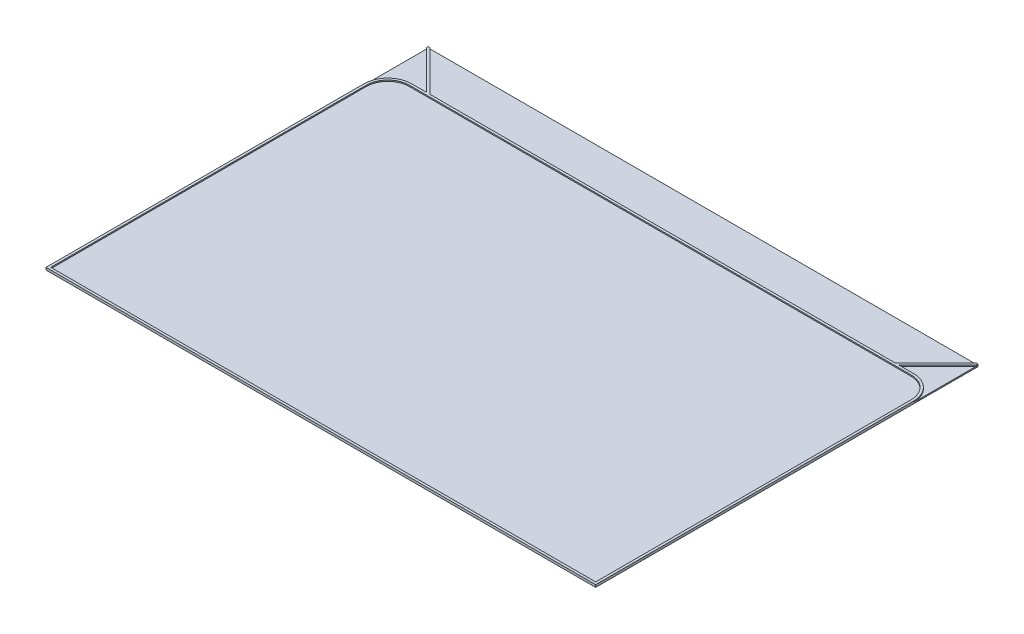
ISO-10303-21;
HEADER;
FILE_DESCRIPTION(('STEP AP214'),'2;1');
FILE_NAME('part.step','',(''),(''),'','','');
FILE_SCHEMA(('AUTOMOTIVE_DESIGN { 1 0 10303 214 1 1 1 1 }'));
ENDSEC;
DATA;
#1=APPLICATION_CONTEXT('core data for automotive mechanical design processes');
#2=APPLICATION_PROTOCOL_DEFINITION('international standard','automotive_design',2000,#1);
#3=PRODUCT_CONTEXT('',#1,'mechanical');
#4=PRODUCT('Part','Part','',(#3));
#5=PRODUCT_RELATED_PRODUCT_CATEGORY('part','',(#4));
#6=PRODUCT_DEFINITION_FORMATION('','',#4);
#7=PRODUCT_DEFINITION_CONTEXT('part definition',#1,'design');
#8=PRODUCT_DEFINITION('design','',#6,#7);
#9=PRODUCT_DEFINITION_SHAPE('','',#8);
#10=(LENGTH_UNIT() NAMED_UNIT(*) SI_UNIT(.MILLI.,.METRE.));
#11=(NAMED_UNIT(*) PLANE_ANGLE_UNIT() SI_UNIT($,.RADIAN.));
#12=(NAMED_UNIT(*) SI_UNIT($,.STERADIAN.) SOLID_ANGLE_UNIT());
#13=UNCERTAINTY_MEASURE_WITH_UNIT(LENGTH_MEASURE(1.E-05),#10,'distance_accuracy_value','');
#14=(GEOMETRIC_REPRESENTATION_CONTEXT(3) GLOBAL_UNCERTAINTY_ASSIGNED_CONTEXT((#13)) GLOBAL_UNIT_ASSIGNED_CONTEXT((#10,
#11,#12)) REPRESENTATION_CONTEXT('',''));
#15=CARTESIAN_POINT('',(0.,0.,0.));
#16=DIRECTION('',(0.,0.,1.));
#17=DIRECTION('',(1.,0.,0.));
#18=AXIS2_PLACEMENT_3D('',#15,#16,#17);
#19=CARTESIAN_POINT('',(0.,0.5,0.));
#20=DIRECTION('',(0.,1.,0.));
#21=DIRECTION('',(0.,0.,1.));
#22=AXIS2_PLACEMENT_3D('',#19,#20,#21);
#23=PLANE('',#22);
#24=DIRECTION('',(-0.707106781186548,0.,-0.707106781186547));
#25=VECTOR('',#24,1.);
#26=CARTESIAN_POINT('',(-17.1464466094066,0.5,17.1464466094067));
#27=LINE('',#26,#25);
#28=CARTESIAN_POINT('',(-97.3223304703364,0.5,-63.0294372515229));
#29=VERTEX_POINT('',#28);
#30=CARTESIAN_POINT('',(-114.292893218814,0.5,-80.));
#31=VERTEX_POINT('',#30);
#32=EDGE_CURVE('E278',#29,#31,#27,.T.);
#33=ORIENTED_EDGE('',*,*,#32,.F.);
#34=DIRECTION('',(-1.,0.,0.));
#35=VECTOR('',#34,1.);
#36=CARTESIAN_POINT('',(0.,0.5,-63.0294372515229));
#37=LINE('',#36,#35);
#38=CARTESIAN_POINT('',(97.3223304703364,0.5,-63.0294372515229));
#39=VERTEX_POINT('',#38);
#40=EDGE_CURVE('E272',#39,#29,#37,.T.);
#41=ORIENTED_EDGE('',*,*,#40,.F.);
#42=DIRECTION('',(0.707106781186548,0.,-0.707106781186547));
#43=VECTOR('',#42,1.);
#44=CARTESIAN_POINT('',(17.1464466094066,0.5,17.1464466094067));
#45=LINE('',#44,#43);
#46=CARTESIAN_POINT('',(114.292893218814,0.5,-80.));
#47=VERTEX_POINT('',#46);
#48=EDGE_CURVE('E275',#39,#47,#45,.T.);
#49=ORIENTED_EDGE('',*,*,#48,.T.);
#50=DIRECTION('',(-1.,0.,0.));
#51=VECTOR('',#50,1.);
#52=CARTESIAN_POINT('',(-115.,0.5,-80.));
#53=LINE('',#52,#51);
#54=EDGE_CURVE('E333',#47,#31,#53,.T.);
#55=ORIENTED_EDGE('',*,*,#54,.T.);
#56=EDGE_LOOP('',(#33,#41,#49,#55));
#57=FACE_BOUND('',#56,.T.);
#58=ADVANCED_FACE('F37',(#57),#23,.T.);
#59=DIRECTION('',(0.,0.,1.));
#60=VECTOR('',#59,1.);
#61=CARTESIAN_POINT('',(-115.,0.5,-80.));
#62=LINE('',#61,#60);
#63=CARTESIAN_POINT('',(-115.,0.5,-79.2928932188135));
#64=VERTEX_POINT('',#63);
#65=CARTESIAN_POINT('',(-115.,0.5,-53.0294372515229));
#66=VERTEX_POINT('',#65);
#67=EDGE_CURVE('E337',#64,#66,#62,.T.);
#68=ORIENTED_EDGE('',*,*,#67,.T.);
#69=CARTESIAN_POINT('',(-105.,0.5,-53.0294372515229));
#70=DIRECTION('',(0.,1.,0.));
#71=DIRECTION('',(0.,0.,1.));
#72=AXIS2_PLACEMENT_3D('',#69,#70,#71);
#73=CIRCLE('',#72,10.);
#74=CARTESIAN_POINT('',(-105.,0.5,-63.0294372515229));
#75=VERTEX_POINT('',#74);
#76=EDGE_CURVE('E191',#66,#75,#73,.F.);
#77=ORIENTED_EDGE('',*,*,#76,.T.);
#78=CARTESIAN_POINT('',(-98.7365440327095,0.5,-63.0294372515229));
#79=VERTEX_POINT('',#78);
#80=EDGE_CURVE('E271',#79,#75,#37,.T.);
#81=ORIENTED_EDGE('',*,*,#80,.F.);
#82=DIRECTION('',(0.707106781186548,0.,0.707106781186548));
#83=VECTOR('',#82,1.);
#84=CARTESIAN_POINT('',(-17.8535533905933,0.5,17.8535533905933));
#85=LINE('',#84,#83);
#86=EDGE_CURVE('E280',#64,#79,#85,.T.);
#87=ORIENTED_EDGE('',*,*,#86,.F.);
#88=EDGE_LOOP('',(#68,#77,#81,#87));
#89=FACE_BOUND('',#88,.T.);
#90=ADVANCED_FACE('F407',(#89),#23,.T.);
#91=DIRECTION('',(0.,0.,-1.));
#92=VECTOR('',#91,1.);
#93=CARTESIAN_POINT('',(115.,0.5,-80.));
#94=LINE('',#93,#92);
#95=CARTESIAN_POINT('',(115.,0.5,-53.0294372515229));
#96=VERTEX_POINT('',#95);
#97=CARTESIAN_POINT('',(115.,0.5,-79.2928932188133));
#98=VERTEX_POINT('',#97);
#99=EDGE_CURVE('E330',#96,#98,#94,.T.);
#100=ORIENTED_EDGE('',*,*,#99,.T.);
#101=DIRECTION('',(-0.707106781186548,0.,0.707106781186548));
#102=VECTOR('',#101,1.);
#103=CARTESIAN_POINT('',(17.8535533905933,0.5,17.8535533905933));
#104=LINE('',#103,#102);
#105=CARTESIAN_POINT('',(98.7365440327095,0.5,-63.0294372515229));
#106=VERTEX_POINT('',#105);
#107=EDGE_CURVE('E270',#98,#106,#104,.T.);
#108=ORIENTED_EDGE('',*,*,#107,.T.);
#109=CARTESIAN_POINT('',(105.,0.5,-63.0294372515229));
#110=VERTEX_POINT('',#109);
#111=EDGE_CURVE('E267',#110,#106,#37,.T.);
#112=ORIENTED_EDGE('',*,*,#111,.F.);
#113=CARTESIAN_POINT('',(105.,0.5,-53.0294372515229));
#114=DIRECTION('',(0.,1.,0.));
#115=DIRECTION('',(0.,0.,1.));
#116=AXIS2_PLACEMENT_3D('',#113,#114,#115);
#117=CIRCLE('',#116,10.);
#118=EDGE_CURVE('E264',#110,#96,#117,.F.);
#119=ORIENTED_EDGE('',*,*,#118,.T.);
#120=EDGE_LOOP('',(#100,#108,#112,#119));
#121=FACE_BOUND('',#120,.T.);
#122=ADVANCED_FACE('F409',(#121),#23,.T.);
#123=CARTESIAN_POINT('',(115.,0.5,-80.));
#124=DIRECTION('',(-1.,0.,0.));
#125=DIRECTION('',(0.,0.,1.));
#126=AXIS2_PLACEMENT_3D('',#123,#124,#125);
#127=PLANE('',#126);
#128=DIRECTION('',(0.,0.,-1.));
#129=VECTOR('',#128,1.);
#130=CARTESIAN_POINT('',(115.,0.,-80.));
#131=LINE('',#130,#129);
#132=CARTESIAN_POINT('',(115.,0.,80.));
#133=VERTEX_POINT('',#132);
#134=CARTESIAN_POINT('',(115.,0.,-80.));
#135=VERTEX_POINT('',#134);
#136=EDGE_CURVE('E306',#133,#135,#131,.T.);
#137=ORIENTED_EDGE('',*,*,#136,.T.);
#138=DIRECTION('',(0.,-1.,0.));
#139=VECTOR('',#138,1.);
#140=CARTESIAN_POINT('',(115.,0.5,-80.));
#141=LINE('',#140,#139);
#142=CARTESIAN_POINT('',(115.,1.,-80.));
#143=VERTEX_POINT('',#142);
#144=EDGE_CURVE('E11',#143,#135,#141,.T.);
#145=ORIENTED_EDGE('',*,*,#144,.F.);
#146=DIRECTION('',(0.,0.,-1.));
#147=VECTOR('',#146,1.);
#148=CARTESIAN_POINT('',(115.,1.,0.));
#149=LINE('',#148,#147);
#150=CARTESIAN_POINT('',(115.,1.,-79.2928932188133));
#151=VERTEX_POINT('',#150);
#152=EDGE_CURVE('E229',#151,#143,#149,.T.);
#153=ORIENTED_EDGE('',*,*,#152,.F.);
#154=DIRECTION('',(0.,-1.,0.));
#155=VECTOR('',#154,1.);
#156=CARTESIAN_POINT('',(115.,1.,-79.2928932188133));
#157=LINE('',#156,#155);
#158=EDGE_CURVE('E323',#151,#98,#157,.T.);
#159=ORIENTED_EDGE('',*,*,#158,.T.);
#160=ORIENTED_EDGE('',*,*,#99,.F.);
#161=DIRECTION('',(0.,-1.,0.));
#162=VECTOR('',#161,1.);
#163=CARTESIAN_POINT('',(115.,1.,-53.0294372515229));
#164=LINE('',#163,#162);
#165=CARTESIAN_POINT('',(115.,1.,-53.0294372515229));
#166=VERTEX_POINT('',#165);
#167=EDGE_CURVE('E196',#166,#96,#164,.T.);
#168=ORIENTED_EDGE('',*,*,#167,.F.);
#169=DIRECTION('',(0.,0.,-1.));
#170=VECTOR('',#169,1.);
#171=CARTESIAN_POINT('',(115.,1.,0.));
#172=LINE('',#171,#170);
#173=CARTESIAN_POINT('',(115.,1.,80.));
#174=VERTEX_POINT('',#173);
#175=EDGE_CURVE('E218',#174,#166,#172,.T.);
#176=ORIENTED_EDGE('',*,*,#175,.F.);
#177=DIRECTION('',(0.,-1.,0.));
#178=VECTOR('',#177,1.);
#179=CARTESIAN_POINT('',(115.,0.5,80.));
#180=LINE('',#179,#178);
#181=EDGE_CURVE('E339',#174,#133,#180,.T.);
#182=ORIENTED_EDGE('',*,*,#181,.T.);
#183=EDGE_LOOP('',(#137,#145,#153,#159,#160,#168,#176,#182));
#184=FACE_BOUND('',#183,.T.);
#185=ADVANCED_FACE('F39',(#184),#127,.F.);
#186=CARTESIAN_POINT('',(-115.,0.5,-80.));
#187=DIRECTION('',(0.,0.,1.));
#188=DIRECTION('',(1.,0.,0.));
#189=AXIS2_PLACEMENT_3D('',#186,#187,#188);
#190=PLANE('',#189);
#191=DIRECTION('',(-1.,0.,0.));
#192=VECTOR('',#191,1.);
#193=CARTESIAN_POINT('',(-115.,0.,-80.));
#194=LINE('',#193,#192);
#195=CARTESIAN_POINT('',(-115.,0.,-80.));
#196=VERTEX_POINT('',#195);
#197=EDGE_CURVE('E342',#135,#196,#194,.T.);
#198=ORIENTED_EDGE('',*,*,#197,.T.);
#199=DIRECTION('',(0.,-1.,0.));
#200=VECTOR('',#199,1.);
#201=CARTESIAN_POINT('',(-115.,0.5,-80.));
#202=LINE('',#201,#200);
#203=CARTESIAN_POINT('',(-115.,1.,-80.));
#204=VERTEX_POINT('',#203);
#205=EDGE_CURVE('E45',#204,#196,#202,.T.);
#206=ORIENTED_EDGE('',*,*,#205,.F.);
#207=DIRECTION('',(-1.,0.,0.));
#208=VECTOR('',#207,1.);
#209=CARTESIAN_POINT('',(0.,1.,-80.));
#210=LINE('',#209,#208);
#211=CARTESIAN_POINT('',(-114.292893218814,1.,-80.));
#212=VERTEX_POINT('',#211);
#213=EDGE_CURVE('E239',#212,#204,#210,.T.);
#214=ORIENTED_EDGE('',*,*,#213,.F.);
#215=DIRECTION('',(0.,-1.,0.));
#216=VECTOR('',#215,1.);
#217=CARTESIAN_POINT('',(-114.292893218814,1.,-80.));
#218=LINE('',#217,#216);
#219=EDGE_CURVE('E313',#212,#31,#218,.T.);
#220=ORIENTED_EDGE('',*,*,#219,.T.);
#221=ORIENTED_EDGE('',*,*,#54,.F.);
#222=DIRECTION('',(0.,-1.,0.));
#223=VECTOR('',#222,1.);
#224=CARTESIAN_POINT('',(114.292893218814,1.,-80.));
#225=LINE('',#224,#223);
#226=CARTESIAN_POINT('',(114.292893218814,1.,-80.));
#227=VERTEX_POINT('',#226);
#228=EDGE_CURVE('E321',#227,#47,#225,.T.);
#229=ORIENTED_EDGE('',*,*,#228,.F.);
#230=DIRECTION('',(-1.,0.,0.));
#231=VECTOR('',#230,1.);
#232=CARTESIAN_POINT('',(0.,1.,-80.));
#233=LINE('',#232,#231);
#234=EDGE_CURVE('E232',#143,#227,#233,.T.);
#235=ORIENTED_EDGE('',*,*,#234,.F.);
#236=ORIENTED_EDGE('',*,*,#144,.T.);
#237=EDGE_LOOP('',(#198,#206,#214,#220,#221,#229,#235,#236));
#238=FACE_BOUND('',#237,.T.);
#239=ADVANCED_FACE('F382',(#238),#190,.F.);
#240=CARTESIAN_POINT('',(-115.,0.5,-80.));
#241=DIRECTION('',(1.,0.,0.));
#242=DIRECTION('',(0.,0.,-1.));
#243=AXIS2_PLACEMENT_3D('',#240,#241,#242);
#244=PLANE('',#243);
#245=DIRECTION('',(0.,0.,1.));
#246=VECTOR('',#245,1.);
#247=CARTESIAN_POINT('',(-115.,0.,-80.));
#248=LINE('',#247,#246);
#249=CARTESIAN_POINT('',(-115.,0.,80.));
#250=VERTEX_POINT('',#249);
#251=EDGE_CURVE('E344',#196,#250,#248,.T.);
#252=ORIENTED_EDGE('',*,*,#251,.T.);
#253=DIRECTION('',(0.,-1.,0.));
#254=VECTOR('',#253,1.);
#255=CARTESIAN_POINT('',(-115.,0.5,80.));
#256=LINE('',#255,#254);
#257=CARTESIAN_POINT('',(-115.,1.,80.));
#258=VERTEX_POINT('',#257);
#259=EDGE_CURVE('E202',#258,#250,#256,.T.);
#260=ORIENTED_EDGE('',*,*,#259,.F.);
#261=DIRECTION('',(0.,0.,1.));
#262=VECTOR('',#261,1.);
#263=CARTESIAN_POINT('',(-115.,1.,0.));
#264=LINE('',#263,#262);
#265=CARTESIAN_POINT('',(-115.,1.,-53.0294372515229));
#266=VERTEX_POINT('',#265);
#267=EDGE_CURVE('E199',#266,#258,#264,.T.);
#268=ORIENTED_EDGE('',*,*,#267,.F.);
#269=DIRECTION('',(0.,-1.,0.));
#270=VECTOR('',#269,1.);
#271=CARTESIAN_POINT('',(-115.,1.,-53.0294372515229));
#272=LINE('',#271,#270);
#273=EDGE_CURVE('E185',#266,#66,#272,.T.);
#274=ORIENTED_EDGE('',*,*,#273,.T.);
#275=ORIENTED_EDGE('',*,*,#67,.F.);
#276=DIRECTION('',(0.,-1.,0.));
#277=VECTOR('',#276,1.);
#278=CARTESIAN_POINT('',(-115.,1.,-79.2928932188135));
#279=LINE('',#278,#277);
#280=CARTESIAN_POINT('',(-115.,1.,-79.2928932188135));
#281=VERTEX_POINT('',#280);
#282=EDGE_CURVE('E311',#281,#64,#279,.T.);
#283=ORIENTED_EDGE('',*,*,#282,.F.);
#284=DIRECTION('',(0.,0.,1.));
#285=VECTOR('',#284,1.);
#286=CARTESIAN_POINT('',(-115.,1.,0.));
#287=LINE('',#286,#285);
#288=EDGE_CURVE('E242',#204,#281,#287,.T.);
#289=ORIENTED_EDGE('',*,*,#288,.F.);
#290=ORIENTED_EDGE('',*,*,#205,.T.);
#291=EDGE_LOOP('',(#252,#260,#268,#274,#275,#283,#289,#290));
#292=FACE_BOUND('',#291,.T.);
#293=ADVANCED_FACE('F200',(#292),#244,.F.);
#294=CARTESIAN_POINT('',(-115.,0.5,80.));
#295=DIRECTION('',(0.,0.,-1.));
#296=DIRECTION('',(-1.,0.,0.));
#297=AXIS2_PLACEMENT_3D('',#294,#295,#296);
#298=PLANE('',#297);
#299=DIRECTION('',(1.,0.,0.));
#300=VECTOR('',#299,1.);
#301=CARTESIAN_POINT('',(-115.,0.,80.));
#302=LINE('',#301,#300);
#303=EDGE_CURVE('E334',#250,#133,#302,.T.);
#304=ORIENTED_EDGE('',*,*,#303,.T.);
#305=ORIENTED_EDGE('',*,*,#181,.F.);
#306=DIRECTION('',(1.,0.,0.));
#307=VECTOR('',#306,1.);
#308=CARTESIAN_POINT('',(0.,1.,80.));
#309=LINE('',#308,#307);
#310=EDGE_CURVE('E206',#258,#174,#309,.T.);
#311=ORIENTED_EDGE('',*,*,#310,.F.);
#312=ORIENTED_EDGE('',*,*,#259,.T.);
#313=EDGE_LOOP('',(#304,#305,#311,#312));
#314=FACE_BOUND('',#313,.T.);
#315=ADVANCED_FACE('F360',(#314),#298,.F.);
#316=CARTESIAN_POINT('',(0.,0.,0.));
#317=DIRECTION('',(0.,1.,0.));
#318=DIRECTION('',(0.,0.,1.));
#319=AXIS2_PLACEMENT_3D('',#316,#317,#318);
#320=PLANE('',#319);
#321=ORIENTED_EDGE('',*,*,#136,.F.);
#322=ORIENTED_EDGE('',*,*,#303,.F.);
#323=ORIENTED_EDGE('',*,*,#251,.F.);
#324=ORIENTED_EDGE('',*,*,#197,.F.);
#325=EDGE_LOOP('',(#321,#322,#323,#324));
#326=FACE_BOUND('',#325,.T.);
#327=ADVANCED_FACE('F358',(#326),#320,.F.);
#328=CARTESIAN_POINT('',(0.,1.,-62.0294372515229));
#329=DIRECTION('',(0.,0.,1.));
#330=DIRECTION('',(1.,0.,0.));
#331=AXIS2_PLACEMENT_3D('',#328,#329,#330);
#332=PLANE('',#331);
#333=DIRECTION('',(-1.,0.,0.));
#334=VECTOR('',#333,1.);
#335=CARTESIAN_POINT('',(0.,0.5,-62.0294372515229));
#336=LINE('',#335,#334);
#337=CARTESIAN_POINT('',(105.,0.5,-62.0294372515229));
#338=VERTEX_POINT('',#337);
#339=CARTESIAN_POINT('',(-105.,0.5,-62.0294372515229));
#340=VERTEX_POINT('',#339);
#341=EDGE_CURVE('E52',#338,#340,#336,.T.);
#342=ORIENTED_EDGE('',*,*,#341,.F.);
#343=DIRECTION('',(0.,-1.,0.));
#344=VECTOR('',#343,1.);
#345=CARTESIAN_POINT('',(105.,1.,-62.0294372515229));
#346=LINE('',#345,#344);
#347=CARTESIAN_POINT('',(105.,1.,-62.0294372515229));
#348=VERTEX_POINT('',#347);
#349=EDGE_CURVE('E303',#348,#338,#346,.T.);
#350=ORIENTED_EDGE('',*,*,#349,.F.);
#351=DIRECTION('',(-1.,0.,0.));
#352=VECTOR('',#351,1.);
#353=CARTESIAN_POINT('',(0.,1.,-62.0294372515229));
#354=LINE('',#353,#352);
#355=CARTESIAN_POINT('',(-105.,1.,-62.0294372515229));
#356=VERTEX_POINT('',#355);
#357=EDGE_CURVE('E246',#348,#356,#354,.T.);
#358=ORIENTED_EDGE('',*,*,#357,.T.);
#359=DIRECTION('',(0.,-1.,0.));
#360=VECTOR('',#359,1.);
#361=CARTESIAN_POINT('',(-105.,1.,-62.0294372515229));
#362=LINE('',#361,#360);
#363=EDGE_CURVE('E195',#356,#340,#362,.T.);
#364=ORIENTED_EDGE('',*,*,#363,.T.);
#365=EDGE_LOOP('',(#342,#350,#358,#364));
#366=FACE_BOUND('',#365,.T.);
#367=ADVANCED_FACE('F424',(#366),#332,.T.);
#368=CARTESIAN_POINT('',(105.,1.,-53.0294372515229));
#369=DIRECTION('',(0.,-1.,0.));
#370=DIRECTION('',(0.,0.,-1.));
#371=AXIS2_PLACEMENT_3D('',#368,#369,#370);
#372=CYLINDRICAL_SURFACE('',#371,9.);
#373=CARTESIAN_POINT('',(105.,0.5,-53.0294372515229));
#374=DIRECTION('',(0.,1.,0.));
#375=DIRECTION('',(0.,0.,1.));
#376=AXIS2_PLACEMENT_3D('',#373,#374,#375);
#377=CIRCLE('',#376,9.);
#378=CARTESIAN_POINT('',(114.,0.5,-53.0294372515229));
#379=VERTEX_POINT('',#378);
#380=EDGE_CURVE('E283',#338,#379,#377,.F.);
#381=ORIENTED_EDGE('',*,*,#380,.T.);
#382=DIRECTION('',(0.,-1.,0.));
#383=VECTOR('',#382,1.);
#384=CARTESIAN_POINT('',(114.,1.,-53.0294372515229));
#385=LINE('',#384,#383);
#386=CARTESIAN_POINT('',(114.,1.,-53.0294372515229));
#387=VERTEX_POINT('',#386);
#388=EDGE_CURVE('E300',#387,#379,#385,.T.);
#389=ORIENTED_EDGE('',*,*,#388,.F.);
#390=CARTESIAN_POINT('',(105.,1.,-53.0294372515229));
#391=DIRECTION('',(0.,1.,0.));
#392=DIRECTION('',(0.,0.,1.));
#393=AXIS2_PLACEMENT_3D('',#390,#391,#392);
#394=CIRCLE('',#393,9.);
#395=EDGE_CURVE('E249',#348,#387,#394,.F.);
#396=ORIENTED_EDGE('',*,*,#395,.F.);
#397=ORIENTED_EDGE('',*,*,#349,.T.);
#398=EDGE_LOOP('',(#381,#389,#396,#397));
#399=FACE_BOUND('',#398,.T.);
#400=ADVANCED_FACE('F466',(#399),#372,.F.);
#401=CARTESIAN_POINT('',(114.,1.,0.));
#402=DIRECTION('',(-1.,0.,0.));
#403=DIRECTION('',(0.,0.,1.));
#404=AXIS2_PLACEMENT_3D('',#401,#402,#403);
#405=PLANE('',#404);
#406=DIRECTION('',(0.,0.,-1.));
#407=VECTOR('',#406,1.);
#408=CARTESIAN_POINT('',(114.,0.5,0.));
#409=LINE('',#408,#407);
#410=CARTESIAN_POINT('',(114.,0.5,79.));
#411=VERTEX_POINT('',#410);
#412=EDGE_CURVE('E286',#411,#379,#409,.T.);
#413=ORIENTED_EDGE('',*,*,#412,.F.);
#414=DIRECTION('',(0.,-1.,0.));
#415=VECTOR('',#414,1.);
#416=CARTESIAN_POINT('',(114.,1.,79.));
#417=LINE('',#416,#415);
#418=CARTESIAN_POINT('',(114.,1.,79.));
#419=VERTEX_POINT('',#418);
#420=EDGE_CURVE('E297',#419,#411,#417,.T.);
#421=ORIENTED_EDGE('',*,*,#420,.F.);
#422=DIRECTION('',(0.,0.,-1.));
#423=VECTOR('',#422,1.);
#424=CARTESIAN_POINT('',(114.,1.,0.));
#425=LINE('',#424,#423);
#426=EDGE_CURVE('E251',#419,#387,#425,.T.);
#427=ORIENTED_EDGE('',*,*,#426,.T.);
#428=ORIENTED_EDGE('',*,*,#388,.T.);
#429=EDGE_LOOP('',(#413,#421,#427,#428));
#430=FACE_BOUND('',#429,.T.);
#431=ADVANCED_FACE('F474',(#430),#405,.T.);
#432=CARTESIAN_POINT('',(0.,1.,79.));
#433=DIRECTION('',(0.,0.,-1.));
#434=DIRECTION('',(-1.,0.,0.));
#435=AXIS2_PLACEMENT_3D('',#432,#433,#434);
#436=PLANE('',#435);
#437=DIRECTION('',(1.,0.,0.));
#438=VECTOR('',#437,1.);
#439=CARTESIAN_POINT('',(0.,0.5,79.));
#440=LINE('',#439,#438);
#441=CARTESIAN_POINT('',(-114.,0.5,79.));
#442=VERTEX_POINT('',#441);
#443=EDGE_CURVE('E288',#442,#411,#440,.T.);
#444=ORIENTED_EDGE('',*,*,#443,.F.);
#445=DIRECTION('',(0.,-1.,0.));
#446=VECTOR('',#445,1.);
#447=CARTESIAN_POINT('',(-114.,1.,79.));
#448=LINE('',#447,#446);
#449=CARTESIAN_POINT('',(-114.,1.,79.));
#450=VERTEX_POINT('',#449);
#451=EDGE_CURVE('E294',#450,#442,#448,.T.);
#452=ORIENTED_EDGE('',*,*,#451,.F.);
#453=DIRECTION('',(1.,0.,0.));
#454=VECTOR('',#453,1.);
#455=CARTESIAN_POINT('',(0.,1.,79.));
#456=LINE('',#455,#454);
#457=EDGE_CURVE('E254',#450,#419,#456,.T.);
#458=ORIENTED_EDGE('',*,*,#457,.T.);
#459=ORIENTED_EDGE('',*,*,#420,.T.);
#460=EDGE_LOOP('',(#444,#452,#458,#459));
#461=FACE_BOUND('',#460,.T.);
#462=ADVANCED_FACE('F482',(#461),#436,.T.);
#463=CARTESIAN_POINT('',(-114.,1.,0.));
#464=DIRECTION('',(1.,0.,0.));
#465=DIRECTION('',(0.,0.,-1.));
#466=AXIS2_PLACEMENT_3D('',#463,#464,#465);
#467=PLANE('',#466);
#468=DIRECTION('',(0.,0.,1.));
#469=VECTOR('',#468,1.);
#470=CARTESIAN_POINT('',(-114.,0.5,0.));
#471=LINE('',#470,#469);
#472=CARTESIAN_POINT('',(-114.,0.5,-53.0294372515229));
#473=VERTEX_POINT('',#472);
#474=EDGE_CURVE('E214',#473,#442,#471,.T.);
#475=ORIENTED_EDGE('',*,*,#474,.F.);
#476=DIRECTION('',(0.,-1.,0.));
#477=VECTOR('',#476,1.);
#478=CARTESIAN_POINT('',(-114.,1.,-53.0294372515229));
#479=LINE('',#478,#477);
#480=CARTESIAN_POINT('',(-114.,1.,-53.0294372515229));
#481=VERTEX_POINT('',#480);
#482=EDGE_CURVE('E292',#481,#473,#479,.T.);
#483=ORIENTED_EDGE('',*,*,#482,.F.);
#484=DIRECTION('',(0.,0.,1.));
#485=VECTOR('',#484,1.);
#486=CARTESIAN_POINT('',(-114.,1.,0.));
#487=LINE('',#486,#485);
#488=EDGE_CURVE('E257',#481,#450,#487,.T.);
#489=ORIENTED_EDGE('',*,*,#488,.T.);
#490=ORIENTED_EDGE('',*,*,#451,.T.);
#491=EDGE_LOOP('',(#475,#483,#489,#490));
#492=FACE_BOUND('',#491,.T.);
#493=ADVANCED_FACE('F490',(#492),#467,.T.);
#494=CARTESIAN_POINT('',(-105.,1.,-53.0294372515229));
#495=DIRECTION('',(0.,-1.,0.));
#496=DIRECTION('',(0.,0.,-1.));
#497=AXIS2_PLACEMENT_3D('',#494,#495,#496);
#498=CYLINDRICAL_SURFACE('',#497,10.);
#499=ORIENTED_EDGE('',*,*,#76,.F.);
#500=ORIENTED_EDGE('',*,*,#273,.F.);
#501=CARTESIAN_POINT('',(-105.,1.,-53.0294372515229));
#502=DIRECTION('',(0.,1.,0.));
#503=DIRECTION('',(0.,0.,1.));
#504=AXIS2_PLACEMENT_3D('',#501,#502,#503);
#505=CIRCLE('',#504,10.);
#506=CARTESIAN_POINT('',(-105.,1.,-63.0294372515229));
#507=VERTEX_POINT('',#506);
#508=EDGE_CURVE('E189',#266,#507,#505,.F.);
#509=ORIENTED_EDGE('',*,*,#508,.T.);
#510=DIRECTION('',(0.,-1.,0.));
#511=VECTOR('',#510,1.);
#512=CARTESIAN_POINT('',(-105.,1.,-63.0294372515229));
#513=LINE('',#512,#511);
#514=EDGE_CURVE('E262',#507,#75,#513,.T.);
#515=ORIENTED_EDGE('',*,*,#514,.T.);
#516=EDGE_LOOP('',(#499,#500,#509,#515));
#517=FACE_BOUND('',#516,.T.);
#518=ADVANCED_FACE('F187',(#517),#498,.T.);
#519=CARTESIAN_POINT('',(105.,1.,-53.0294372515229));
#520=DIRECTION('',(0.,-1.,0.));
#521=DIRECTION('',(0.,0.,-1.));
#522=AXIS2_PLACEMENT_3D('',#519,#520,#521);
#523=CYLINDRICAL_SURFACE('',#522,10.);
#524=ORIENTED_EDGE('',*,*,#118,.F.);
#525=DIRECTION('',(0.,-1.,0.));
#526=VECTOR('',#525,1.);
#527=CARTESIAN_POINT('',(105.,1.,-63.0294372515229));
#528=LINE('',#527,#526);
#529=CARTESIAN_POINT('',(105.,1.,-63.0294372515229));
#530=VERTEX_POINT('',#529);
#531=EDGE_CURVE('E327',#530,#110,#528,.T.);
#532=ORIENTED_EDGE('',*,*,#531,.F.);
#533=CARTESIAN_POINT('',(105.,1.,-53.0294372515229));
#534=DIRECTION('',(0.,1.,0.));
#535=DIRECTION('',(0.,0.,1.));
#536=AXIS2_PLACEMENT_3D('',#533,#534,#535);
#537=CIRCLE('',#536,10.);
#538=EDGE_CURVE('E220',#530,#166,#537,.F.);
#539=ORIENTED_EDGE('',*,*,#538,.T.);
#540=ORIENTED_EDGE('',*,*,#167,.T.);
#541=EDGE_LOOP('',(#524,#532,#539,#540));
#542=FACE_BOUND('',#541,.T.);
#543=ADVANCED_FACE('F371',(#542),#523,.T.);
#544=CARTESIAN_POINT('',(0.,1.,-63.0294372515229));
#545=DIRECTION('',(0.,0.,1.));
#546=DIRECTION('',(1.,0.,0.));
#547=AXIS2_PLACEMENT_3D('',#544,#545,#546);
#548=PLANE('',#547);
#549=ORIENTED_EDGE('',*,*,#111,.T.);
#550=DIRECTION('',(0.,-1.,0.));
#551=VECTOR('',#550,1.);
#552=CARTESIAN_POINT('',(98.7365440327095,1.,-63.0294372515229));
#553=LINE('',#552,#551);
#554=CARTESIAN_POINT('',(98.7365440327095,1.,-63.0294372515229));
#555=VERTEX_POINT('',#554);
#556=EDGE_CURVE('E325',#555,#106,#553,.T.);
#557=ORIENTED_EDGE('',*,*,#556,.F.);
#558=DIRECTION('',(-1.,0.,0.));
#559=VECTOR('',#558,1.);
#560=CARTESIAN_POINT('',(0.,1.,-63.0294372515229));
#561=LINE('',#560,#559);
#562=EDGE_CURVE('E223',#530,#555,#561,.T.);
#563=ORIENTED_EDGE('',*,*,#562,.F.);
#564=ORIENTED_EDGE('',*,*,#531,.T.);
#565=EDGE_LOOP('',(#549,#557,#563,#564));
#566=FACE_BOUND('',#565,.T.);
#567=ADVANCED_FACE('F374',(#566),#548,.F.);
#568=CARTESIAN_POINT('',(17.8535533905933,1.,17.8535533905933));
#569=DIRECTION('',(0.707106781186547,0.,0.707106781186547));
#570=DIRECTION('',(0.707106781186548,0.,-0.707106781186548));
#571=AXIS2_PLACEMENT_3D('',#568,#569,#570);
#572=PLANE('',#571);
#573=ORIENTED_EDGE('',*,*,#107,.F.);
#574=ORIENTED_EDGE('',*,*,#158,.F.);
#575=DIRECTION('',(-0.707106781186548,0.,0.707106781186548));
#576=VECTOR('',#575,1.);
#577=CARTESIAN_POINT('',(17.8535533905933,1.,17.8535533905933));
#578=LINE('',#577,#576);
#579=EDGE_CURVE('E225',#151,#555,#578,.T.);
#580=ORIENTED_EDGE('',*,*,#579,.T.);
#581=ORIENTED_EDGE('',*,*,#556,.T.);
#582=EDGE_LOOP('',(#573,#574,#580,#581));
#583=FACE_BOUND('',#582,.T.);
#584=ADVANCED_FACE('F377',(#583),#572,.T.);
#585=CARTESIAN_POINT('',(17.1464466094066,1.,17.1464466094067));
#586=DIRECTION('',(-0.707106781186547,0.,-0.707106781186548));
#587=DIRECTION('',(-0.707106781186548,0.,0.707106781186547));
#588=AXIS2_PLACEMENT_3D('',#585,#586,#587);
#589=PLANE('',#588);
#590=ORIENTED_EDGE('',*,*,#48,.F.);
#591=DIRECTION('',(0.,-1.,0.));
#592=VECTOR('',#591,1.);
#593=CARTESIAN_POINT('',(97.3223304703364,1.,-63.0294372515229));
#594=LINE('',#593,#592);
#595=CARTESIAN_POINT('',(97.3223304703364,1.,-63.0294372515229));
#596=VERTEX_POINT('',#595);
#597=EDGE_CURVE('E319',#596,#39,#594,.T.);
#598=ORIENTED_EDGE('',*,*,#597,.F.);
#599=DIRECTION('',(0.707106781186548,0.,-0.707106781186547));
#600=VECTOR('',#599,1.);
#601=CARTESIAN_POINT('',(17.1464466094066,1.,17.1464466094067));
#602=LINE('',#601,#600);
#603=EDGE_CURVE('E234',#596,#227,#602,.T.);
#604=ORIENTED_EDGE('',*,*,#603,.T.);
#605=ORIENTED_EDGE('',*,*,#228,.T.);
#606=EDGE_LOOP('',(#590,#598,#604,#605));
#607=FACE_BOUND('',#606,.T.);
#608=ADVANCED_FACE('F386',(#607),#589,.T.);
#609=ORIENTED_EDGE('',*,*,#40,.T.);
#610=DIRECTION('',(0.,-1.,0.));
#611=VECTOR('',#610,1.);
#612=CARTESIAN_POINT('',(-97.3223304703364,1.,-63.0294372515229));
#613=LINE('',#612,#611);
#614=CARTESIAN_POINT('',(-97.3223304703364,1.,-63.0294372515229));
#615=VERTEX_POINT('',#614);
#616=EDGE_CURVE('E316',#615,#29,#613,.T.);
#617=ORIENTED_EDGE('',*,*,#616,.F.);
#618=EDGE_CURVE('E226',#596,#615,#561,.T.);
#619=ORIENTED_EDGE('',*,*,#618,.F.);
#620=ORIENTED_EDGE('',*,*,#597,.T.);
#621=EDGE_LOOP('',(#609,#617,#619,#620));
#622=FACE_BOUND('',#621,.T.);
#623=ADVANCED_FACE('F392',(#622),#548,.F.);
#624=CARTESIAN_POINT('',(-17.1464466094066,1.,17.1464466094067));
#625=DIRECTION('',(-0.707106781186547,0.,0.707106781186548));
#626=DIRECTION('',(0.707106781186548,0.,0.707106781186547));
#627=AXIS2_PLACEMENT_3D('',#624,#625,#626);
#628=PLANE('',#627);
#629=ORIENTED_EDGE('',*,*,#32,.T.);
#630=ORIENTED_EDGE('',*,*,#219,.F.);
#631=DIRECTION('',(-0.707106781186548,0.,-0.707106781186547));
#632=VECTOR('',#631,1.);
#633=CARTESIAN_POINT('',(-17.1464466094066,1.,17.1464466094067));
#634=LINE('',#633,#632);
#635=EDGE_CURVE('E237',#615,#212,#634,.T.);
#636=ORIENTED_EDGE('',*,*,#635,.F.);
#637=ORIENTED_EDGE('',*,*,#616,.T.);
#638=EDGE_LOOP('',(#629,#630,#636,#637));
#639=FACE_BOUND('',#638,.T.);
#640=ADVANCED_FACE('F396',(#639),#628,.F.);
#641=CARTESIAN_POINT('',(-17.8535533905933,1.,17.8535533905933));
#642=DIRECTION('',(0.707106781186547,0.,-0.707106781186547));
#643=DIRECTION('',(-0.707106781186548,0.,-0.707106781186548));
#644=AXIS2_PLACEMENT_3D('',#641,#642,#643);
#645=PLANE('',#644);
#646=ORIENTED_EDGE('',*,*,#86,.T.);
#647=DIRECTION('',(0.,-1.,0.));
#648=VECTOR('',#647,1.);
#649=CARTESIAN_POINT('',(-98.7365440327095,1.,-63.0294372515229));
#650=LINE('',#649,#648);
#651=CARTESIAN_POINT('',(-98.7365440327095,1.,-63.0294372515229));
#652=VERTEX_POINT('',#651);
#653=EDGE_CURVE('E308',#652,#79,#650,.T.);
#654=ORIENTED_EDGE('',*,*,#653,.F.);
#655=DIRECTION('',(0.707106781186548,0.,0.707106781186548));
#656=VECTOR('',#655,1.);
#657=CARTESIAN_POINT('',(-17.8535533905933,1.,17.8535533905933));
#658=LINE('',#657,#656);
#659=EDGE_CURVE('E244',#281,#652,#658,.T.);
#660=ORIENTED_EDGE('',*,*,#659,.F.);
#661=ORIENTED_EDGE('',*,*,#282,.T.);
#662=EDGE_LOOP('',(#646,#654,#660,#661));
#663=FACE_BOUND('',#662,.T.);
#664=ADVANCED_FACE('F401',(#663),#645,.F.);
#665=ORIENTED_EDGE('',*,*,#80,.T.);
#666=ORIENTED_EDGE('',*,*,#514,.F.);
#667=EDGE_CURVE('E211',#652,#507,#561,.T.);
#668=ORIENTED_EDGE('',*,*,#667,.F.);
#669=ORIENTED_EDGE('',*,*,#653,.T.);
#670=EDGE_LOOP('',(#665,#666,#668,#669));
#671=FACE_BOUND('',#670,.T.);
#672=ADVANCED_FACE('F405',(#671),#548,.F.);
#673=CARTESIAN_POINT('',(-105.,1.,-53.0294372515229));
#674=DIRECTION('',(0.,-1.,0.));
#675=DIRECTION('',(0.,0.,-1.));
#676=AXIS2_PLACEMENT_3D('',#673,#674,#675);
#677=CYLINDRICAL_SURFACE('',#676,9.);
#678=CARTESIAN_POINT('',(-105.,0.5,-53.0294372515229));
#679=DIRECTION('',(0.,1.,0.));
#680=DIRECTION('',(0.,0.,1.));
#681=AXIS2_PLACEMENT_3D('',#678,#679,#680);
#682=CIRCLE('',#681,9.);
#683=EDGE_CURVE('E57',#473,#340,#682,.F.);
#684=ORIENTED_EDGE('',*,*,#683,.T.);
#685=ORIENTED_EDGE('',*,*,#363,.F.);
#686=CARTESIAN_POINT('',(-105.,1.,-53.0294372515229));
#687=DIRECTION('',(0.,1.,0.));
#688=DIRECTION('',(0.,0.,1.));
#689=AXIS2_PLACEMENT_3D('',#686,#687,#688);
#690=CIRCLE('',#689,9.);
#691=EDGE_CURVE('E260',#481,#356,#690,.F.);
#692=ORIENTED_EDGE('',*,*,#691,.F.);
#693=ORIENTED_EDGE('',*,*,#482,.T.);
#694=EDGE_LOOP('',(#684,#685,#692,#693));
#695=FACE_BOUND('',#694,.T.);
#696=ADVANCED_FACE('F550',(#695),#677,.F.);
#697=CARTESIAN_POINT('',(0.,1.,0.));
#698=DIRECTION('',(0.,1.,0.));
#699=DIRECTION('',(0.,0.,1.));
#700=AXIS2_PLACEMENT_3D('',#697,#698,#699);
#701=PLANE('',#700);
#702=ORIENTED_EDGE('',*,*,#508,.F.);
#703=ORIENTED_EDGE('',*,*,#267,.T.);
#704=ORIENTED_EDGE('',*,*,#310,.T.);
#705=ORIENTED_EDGE('',*,*,#175,.T.);
#706=ORIENTED_EDGE('',*,*,#538,.F.);
#707=ORIENTED_EDGE('',*,*,#562,.T.);
#708=ORIENTED_EDGE('',*,*,#579,.F.);
#709=ORIENTED_EDGE('',*,*,#152,.T.);
#710=ORIENTED_EDGE('',*,*,#234,.T.);
#711=ORIENTED_EDGE('',*,*,#603,.F.);
#712=ORIENTED_EDGE('',*,*,#618,.T.);
#713=ORIENTED_EDGE('',*,*,#635,.T.);
#714=ORIENTED_EDGE('',*,*,#213,.T.);
#715=ORIENTED_EDGE('',*,*,#288,.T.);
#716=ORIENTED_EDGE('',*,*,#659,.T.);
#717=ORIENTED_EDGE('',*,*,#667,.T.);
#718=EDGE_LOOP('',(#702,#703,#704,#705,#706,#707,#708,#709,#710,#711,#712,#713,#714,#715,#716,#717));
#719=FACE_BOUND('',#718,.T.);
#720=ORIENTED_EDGE('',*,*,#357,.F.);
#721=ORIENTED_EDGE('',*,*,#395,.T.);
#722=ORIENTED_EDGE('',*,*,#426,.F.);
#723=ORIENTED_EDGE('',*,*,#457,.F.);
#724=ORIENTED_EDGE('',*,*,#488,.F.);
#725=ORIENTED_EDGE('',*,*,#691,.T.);
#726=EDGE_LOOP('',(#720,#721,#722,#723,#724,#725));
#727=FACE_BOUND('',#726,.T.);
#728=ADVANCED_FACE('F208',(#719,#727),#701,.T.);
#729=ORIENTED_EDGE('',*,*,#380,.F.);
#730=ORIENTED_EDGE('',*,*,#341,.T.);
#731=ORIENTED_EDGE('',*,*,#683,.F.);
#732=ORIENTED_EDGE('',*,*,#474,.T.);
#733=ORIENTED_EDGE('',*,*,#443,.T.);
#734=ORIENTED_EDGE('',*,*,#412,.T.);
#735=EDGE_LOOP('',(#729,#730,#731,#732,#733,#734));
#736=FACE_BOUND('',#735,.T.);
#737=ADVANCED_FACE('F416',(#736),#23,.T.);
#738=CLOSED_SHELL('',(#58,#90,#122,#185,#239,#293,#315,#327,#367,#400,#431,#462,#493,#518,#543,
#567,#584,#608,#623,#640,#664,#672,#696,#728,#737));
#739=MANIFOLD_SOLID_BREP('B2',#738);
#740=ADVANCED_BREP_SHAPE_REPRESENTATION('',(#18,#739),#14);
#741=SHAPE_DEFINITION_REPRESENTATION(#9,#740);
ENDSEC;
END-ISO-10303-21;
